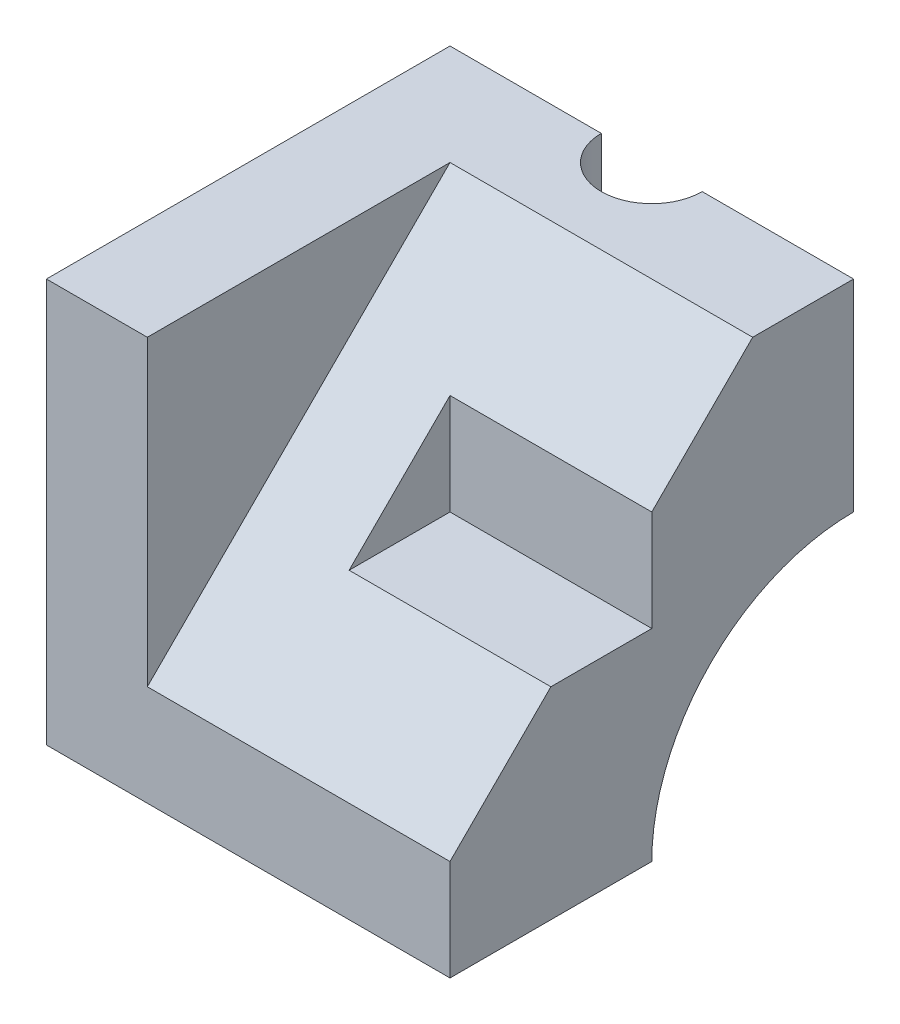
ISO-10303-21;
HEADER;
FILE_DESCRIPTION(('STEP AP214'),'2;1');
FILE_NAME('part.step','',(''),(''),'','','');
FILE_SCHEMA(('AUTOMOTIVE_DESIGN { 1 0 10303 214 1 1 1 1 }'));
ENDSEC;
DATA;
#1=APPLICATION_CONTEXT('core data for automotive mechanical design processes');
#2=APPLICATION_PROTOCOL_DEFINITION('international standard','automotive_design',2000,#1);
#3=PRODUCT_CONTEXT('',#1,'mechanical');
#4=PRODUCT('Part','Part','',(#3));
#5=PRODUCT_RELATED_PRODUCT_CATEGORY('part','',(#4));
#6=PRODUCT_DEFINITION_FORMATION('','',#4);
#7=PRODUCT_DEFINITION_CONTEXT('part definition',#1,'design');
#8=PRODUCT_DEFINITION('design','',#6,#7);
#9=PRODUCT_DEFINITION_SHAPE('','',#8);
#10=(LENGTH_UNIT() NAMED_UNIT(*) SI_UNIT(.MILLI.,.METRE.));
#11=(NAMED_UNIT(*) PLANE_ANGLE_UNIT() SI_UNIT($,.RADIAN.));
#12=(NAMED_UNIT(*) SI_UNIT($,.STERADIAN.) SOLID_ANGLE_UNIT());
#13=UNCERTAINTY_MEASURE_WITH_UNIT(LENGTH_MEASURE(1.E-05),#10,'distance_accuracy_value','');
#14=(GEOMETRIC_REPRESENTATION_CONTEXT(3) GLOBAL_UNCERTAINTY_ASSIGNED_CONTEXT((#13)) GLOBAL_UNIT_ASSIGNED_CONTEXT((#10,
#11,#12)) REPRESENTATION_CONTEXT('',''));
#15=CARTESIAN_POINT('',(0.,0.,0.));
#16=DIRECTION('',(0.,0.,1.));
#17=DIRECTION('',(1.,0.,0.));
#18=AXIS2_PLACEMENT_3D('',#15,#16,#17);
#19=CARTESIAN_POINT('',(0.,80.,40.));
#20=DIRECTION('',(0.,-1.,0.));
#21=DIRECTION('',(0.,0.,-1.));
#22=AXIS2_PLACEMENT_3D('',#19,#20,#21);
#23=PLANE('',#22);
#24=CARTESIAN_POINT('',(40.,80.,-40.));
#25=DIRECTION('',(0.,1.,0.));
#26=DIRECTION('',(0.,0.,1.));
#27=AXIS2_PLACEMENT_3D('',#24,#25,#26);
#28=CIRCLE('',#27,10.);
#29=CARTESIAN_POINT('',(30.,80.,-40.));
#30=VERTEX_POINT('',#29);
#31=CARTESIAN_POINT('',(50.,80.,-40.));
#32=VERTEX_POINT('',#31);
#33=EDGE_CURVE('E134',#30,#32,#28,.T.);
#34=ORIENTED_EDGE('',*,*,#33,.F.);
#35=DIRECTION('',(-1.,0.,0.));
#36=VECTOR('',#35,1.);
#37=CARTESIAN_POINT('',(0.,80.,-40.));
#38=LINE('',#37,#36);
#39=CARTESIAN_POINT('',(0.,80.,-40.));
#40=VERTEX_POINT('',#39);
#41=EDGE_CURVE('E143',#30,#40,#38,.T.);
#42=ORIENTED_EDGE('',*,*,#41,.T.);
#43=DIRECTION('',(0.,0.,-1.));
#44=VECTOR('',#43,1.);
#45=CARTESIAN_POINT('',(0.,80.,40.));
#46=LINE('',#45,#44);
#47=CARTESIAN_POINT('',(0.,80.,40.));
#48=VERTEX_POINT('',#47);
#49=EDGE_CURVE('E164',#48,#40,#46,.T.);
#50=ORIENTED_EDGE('',*,*,#49,.F.);
#51=DIRECTION('',(-1.,0.,0.));
#52=VECTOR('',#51,1.);
#53=CARTESIAN_POINT('',(0.,80.,40.));
#54=LINE('',#53,#52);
#55=CARTESIAN_POINT('',(20.,80.,40.));
#56=VERTEX_POINT('',#55);
#57=EDGE_CURVE('E187',#56,#48,#54,.T.);
#58=ORIENTED_EDGE('',*,*,#57,.F.);
#59=DIRECTION('',(0.,0.,-1.));
#60=VECTOR('',#59,1.);
#61=CARTESIAN_POINT('',(20.,80.,40.));
#62=LINE('',#61,#60);
#63=CARTESIAN_POINT('',(20.,80.,-20.));
#64=VERTEX_POINT('',#63);
#65=EDGE_CURVE('E167',#56,#64,#62,.T.);
#66=ORIENTED_EDGE('',*,*,#65,.T.);
#67=DIRECTION('',(-1.,0.,0.));
#68=VECTOR('',#67,1.);
#69=CARTESIAN_POINT('',(80.,80.,-20.));
#70=LINE('',#69,#68);
#71=CARTESIAN_POINT('',(80.,80.,-20.));
#72=VERTEX_POINT('',#71);
#73=EDGE_CURVE('E193',#72,#64,#70,.T.);
#74=ORIENTED_EDGE('',*,*,#73,.F.);
#75=DIRECTION('',(0.,0.,1.));
#76=VECTOR('',#75,1.);
#77=CARTESIAN_POINT('',(80.,80.,-40.));
#78=LINE('',#77,#76);
#79=CARTESIAN_POINT('',(80.,80.,-40.));
#80=VERTEX_POINT('',#79);
#81=EDGE_CURVE('E215',#80,#72,#78,.T.);
#82=ORIENTED_EDGE('',*,*,#81,.F.);
#83=EDGE_CURVE('E146',#80,#32,#38,.T.);
#84=ORIENTED_EDGE('',*,*,#83,.T.);
#85=EDGE_LOOP('',(#34,#42,#50,#58,#66,#74,#82,#84));
#86=FACE_BOUND('',#85,.T.);
#87=ADVANCED_FACE('F32',(#86),#23,.F.);
#88=CARTESIAN_POINT('',(0.,0.,-40.));
#89=DIRECTION('',(0.,0.,-1.));
#90=DIRECTION('',(-1.,0.,0.));
#91=AXIS2_PLACEMENT_3D('',#88,#89,#90);
#92=PLANE('',#91);
#93=DIRECTION('',(-1.,0.,0.));
#94=VECTOR('',#93,1.);
#95=CARTESIAN_POINT('',(80.,40.,-40.));
#96=LINE('',#95,#94);
#97=CARTESIAN_POINT('',(80.,40.,-40.));
#98=VERTEX_POINT('',#97);
#99=CARTESIAN_POINT('',(50.,40.,-40.));
#100=VERTEX_POINT('',#99);
#101=EDGE_CURVE('E201',#98,#100,#96,.T.);
#102=ORIENTED_EDGE('',*,*,#101,.T.);
#103=DIRECTION('',(0.,-1.,0.));
#104=VECTOR('',#103,1.);
#105=CARTESIAN_POINT('',(50.,80.,-40.));
#106=LINE('',#105,#104);
#107=EDGE_CURVE('E52',#32,#100,#106,.T.);
#108=ORIENTED_EDGE('',*,*,#107,.F.);
#109=ORIENTED_EDGE('',*,*,#83,.F.);
#110=DIRECTION('',(0.,1.,0.));
#111=VECTOR('',#110,1.);
#112=CARTESIAN_POINT('',(80.,80.,-40.));
#113=LINE('',#112,#111);
#114=EDGE_CURVE('E217',#98,#80,#113,.T.);
#115=ORIENTED_EDGE('',*,*,#114,.F.);
#116=EDGE_LOOP('',(#102,#108,#109,#115));
#117=FACE_BOUND('',#116,.T.);
#118=ADVANCED_FACE('F268',(#117),#92,.T.);
#119=ORIENTED_EDGE('',*,*,#41,.F.);
#120=DIRECTION('',(0.,-1.,0.));
#121=VECTOR('',#120,1.);
#122=CARTESIAN_POINT('',(30.,80.,-40.));
#123=LINE('',#122,#121);
#124=CARTESIAN_POINT('',(30.,40.,-40.));
#125=VERTEX_POINT('',#124);
#126=EDGE_CURVE('E131',#30,#125,#123,.T.);
#127=ORIENTED_EDGE('',*,*,#126,.T.);
#128=CARTESIAN_POINT('',(20.,40.,-40.));
#129=VERTEX_POINT('',#128);
#130=EDGE_CURVE('E179',#125,#129,#96,.T.);
#131=ORIENTED_EDGE('',*,*,#130,.T.);
#132=DIRECTION('',(0.,1.,0.));
#133=VECTOR('',#132,1.);
#134=CARTESIAN_POINT('',(20.,80.,-40.));
#135=LINE('',#134,#133);
#136=CARTESIAN_POINT('',(20.,0.,-40.));
#137=VERTEX_POINT('',#136);
#138=EDGE_CURVE('E153',#137,#129,#135,.T.);
#139=ORIENTED_EDGE('',*,*,#138,.F.);
#140=DIRECTION('',(1.,0.,0.));
#141=VECTOR('',#140,1.);
#142=CARTESIAN_POINT('',(20.,0.,-40.));
#143=LINE('',#142,#141);
#144=CARTESIAN_POINT('',(0.,0.,-40.));
#145=VERTEX_POINT('',#144);
#146=EDGE_CURVE('E156',#145,#137,#143,.T.);
#147=ORIENTED_EDGE('',*,*,#146,.F.);
#148=DIRECTION('',(0.,-1.,0.));
#149=VECTOR('',#148,1.);
#150=CARTESIAN_POINT('',(0.,0.,-40.));
#151=LINE('',#150,#149);
#152=EDGE_CURVE('E152',#40,#145,#151,.T.);
#153=ORIENTED_EDGE('',*,*,#152,.F.);
#154=EDGE_LOOP('',(#119,#127,#131,#139,#147,#153));
#155=FACE_BOUND('',#154,.T.);
#156=ADVANCED_FACE('F149',(#155),#92,.T.);
#157=CARTESIAN_POINT('',(80.,0.,-40.));
#158=DIRECTION('',(-1.,0.,0.));
#159=DIRECTION('',(0.,0.,1.));
#160=AXIS2_PLACEMENT_3D('',#157,#158,#159);
#161=CYLINDRICAL_SURFACE('',#160,40.);
#162=CARTESIAN_POINT('',(50.,40.,-40.));
#163=CARTESIAN_POINT('',(50.0000347665634,40.0000283042969,-39.723317328283));
#164=CARTESIAN_POINT('',(49.9885185471952,39.9971302511347,-39.4466450005706));
#165=CARTESIAN_POINT('',(49.9426393211118,39.9856869917149,-38.8953604008497));
#166=CARTESIAN_POINT('',(49.9082798676551,39.9771426637348,-38.6207478151663));
#167=CARTESIAN_POINT('',(49.8170559310698,39.9546336953666,-38.0760525685714));
#168=CARTESIAN_POINT('',(49.7602343187812,39.9406793813447,-37.8059622941188));
#169=CARTESIAN_POINT('',(49.6245652514397,39.9077423587186,-37.2716860705147));
#170=CARTESIAN_POINT('',(49.5457175626522,39.8887595967542,-37.007500184051));
#171=CARTESIAN_POINT('',(49.3666470764717,39.8462862503233,-36.4869280686835));
#172=CARTESIAN_POINT('',(49.266429689706,39.8227968070611,-36.230539884208));
#173=CARTESIAN_POINT('',(49.0453370055672,39.7719316584919,-35.727122115615));
#174=CARTESIAN_POINT('',(48.9244540790586,39.744554518591,-35.4800960290141));
#175=CARTESIAN_POINT('',(48.6629426466438,39.686651714144,-34.9971167522794));
#176=CARTESIAN_POINT('',(48.5223140991924,39.6561260429733,-34.7611635854447));
#177=CARTESIAN_POINT('',(48.2222923619033,39.5927341730655,-34.3018279358429));
#178=CARTESIAN_POINT('',(48.0628983449775,39.5598678711903,-34.078446007795));
#179=CARTESIAN_POINT('',(47.7233322633288,39.4920458815768,-33.6416945303948));
#180=CARTESIAN_POINT('',(47.5428327323561,39.4570629286792,-33.42858375593));
#181=CARTESIAN_POINT('',(47.1647023313839,39.3865264597594,-33.0182464174608));
#182=CARTESIAN_POINT('',(46.967071285234,39.3509729378736,-32.8210200168236));
#183=CARTESIAN_POINT('',(46.5559340088343,39.2802655885801,-32.4437050342399));
#184=CARTESIAN_POINT('',(46.342424630118,39.2451118420444,-32.2636198674033));
#185=CARTESIAN_POINT('',(45.9009576655237,39.1761888998175,-31.9218428341867));
#186=CARTESIAN_POINT('',(45.6730004516109,39.1424196685183,-31.7601504945756));
#187=CARTESIAN_POINT('',(45.2005695624557,39.0767244907518,-31.4539776832615));
#188=CARTESIAN_POINT('',(44.955898463365,39.0448340781449,-31.3097939823785));
#189=CARTESIAN_POINT('',(44.4549489475385,38.9844171612595,-31.0426580003598));
#190=CARTESIAN_POINT('',(44.1986750250383,38.9558893696743,-30.9196975859233));
#191=CARTESIAN_POINT('',(43.6762104939899,38.9030460323612,-30.6959020142231));
#192=CARTESIAN_POINT('',(43.4100196626681,38.8787305813287,-30.5950673543438));
#193=CARTESIAN_POINT('',(42.8696420404606,38.8350658200059,-30.4163611118489));
#194=CARTESIAN_POINT('',(42.5954554418739,38.8157163903918,-30.3384889774814));
#195=CARTESIAN_POINT('',(42.0466655263122,38.7829257133539,-30.2077004607008));
#196=CARTESIAN_POINT('',(41.7721803871258,38.7693739659701,-30.154315788423));
#197=CARTESIAN_POINT('',(41.2194826673782,38.7480437402112,-30.070701223761));
#198=CARTESIAN_POINT('',(40.9412701318527,38.7402651921463,-30.040471051872));
#199=CARTESIAN_POINT('',(40.3832205025106,38.7307247036798,-30.0034340255133));
#200=CARTESIAN_POINT('',(40.1033836066688,38.7289620448772,-29.9966243742286));
#201=CARTESIAN_POINT('',(39.5441535158876,38.7315067768714,-30.0064816189487));
#202=CARTESIAN_POINT('',(39.2647603148346,38.7358140832899,-30.0231481886118));
#203=CARTESIAN_POINT('',(38.7152685490798,38.7501861910842,-30.0791192160617));
#204=CARTESIAN_POINT('',(38.4451090329656,38.760108640408,-30.1178641187879));
#205=CARTESIAN_POINT('',(37.9091057010663,38.7853086981301,-30.2172369545841));
#206=CARTESIAN_POINT('',(37.6432618050661,38.8005862068736,-30.277864480431));
#207=CARTESIAN_POINT('',(37.1177545814724,38.8360478604504,-30.4205021508954));
#208=CARTESIAN_POINT('',(36.8580903753497,38.8562313032062,-30.502509236053));
#209=CARTESIAN_POINT('',(36.3465439458482,38.9009355349684,-30.6873072107764));
#210=CARTESIAN_POINT('',(36.0946647294828,38.9254579759487,-30.7901060184533));
#211=CARTESIAN_POINT('',(35.5980344076375,38.9784009900661,-31.0167975077233));
#212=CARTESIAN_POINT('',(35.3533759391039,39.0068570093329,-31.140884801447));
#213=CARTESIAN_POINT('',(34.8752382160931,39.0666979328467,-31.4086132375937));
#214=CARTESIAN_POINT('',(34.6417640168323,39.0980841429688,-31.5522631115253));
#215=CARTESIAN_POINT('',(34.1875569055162,39.1629155393051,-31.8581037115353));
#216=CARTESIAN_POINT('',(33.9668255286815,39.19636097261,-32.0202966646469));
#217=CARTESIAN_POINT('',(33.539602931786,39.2643892775372,-32.3620636225994));
#218=CARTESIAN_POINT('',(33.3331057748481,39.2989716659545,-32.541630305084));
#219=CARTESIAN_POINT('',(32.9297970941818,39.369368886371,-32.9224753503197));
#220=CARTESIAN_POINT('',(32.7334367633066,39.4051904945485,-33.1242305799012));
#221=CARTESIAN_POINT('',(32.3584232949008,39.4760660657393,-33.5435766715787));
#222=CARTESIAN_POINT('',(32.1797642662635,39.5111202810997,-33.7611622231484));
#223=CARTESIAN_POINT('',(31.8412277437747,39.579515677554,-34.2108993137889));
#224=CARTESIAN_POINT('',(31.6813588550706,39.6128560698821,-34.44305745245));
#225=CARTESIAN_POINT('',(31.3816454248162,39.6768773388274,-34.9202994691606));
#226=CARTESIAN_POINT('',(31.2418002226583,39.7075583031693,-35.1653829204218));
#227=CARTESIAN_POINT('',(30.9826505576209,39.7655198411576,-35.6678373170845));
#228=CARTESIAN_POINT('',(30.8634312432958,39.7927861964175,-35.9252538474225));
#229=CARTESIAN_POINT('',(30.6471722625592,39.8429958536219,-36.4496417413058));
#230=CARTESIAN_POINT('',(30.5501316636389,39.8659393373152,-36.7166127025868));
#231=CARTESIAN_POINT('',(30.3791286205496,39.9068198810981,-37.2578676682618));
#232=CARTESIAN_POINT('',(30.3051387882489,39.9247628798976,-37.5321425703149));
#233=CARTESIAN_POINT('',(30.1807419429283,39.9551523105591,-38.0861740557706));
#234=CARTESIAN_POINT('',(30.1303239751867,39.9676012955425,-38.3659280297372));
#235=CARTESIAN_POINT('',(30.0612981868894,39.9847081712133,-38.8715529561821));
#236=CARTESIAN_POINT('',(30.038304107234,39.9904362059273,-39.0967995262256));
#237=CARTESIAN_POINT('',(30.0076612546209,39.9980848315484,-39.5480246224444));
#238=CARTESIAN_POINT('',(29.9999872514112,40.0000116824683,-39.7740013302568));
#239=CARTESIAN_POINT('',(30.,40.,-40.));
#240=B_SPLINE_CURVE_WITH_KNOTS('',3,(#162,#163,#164,#165,#166,#167,#168,#169,#170,#171,#172,
#173,#174,#175,#176,#177,#178,#179,#180,#181,#182,#183,#184,#185,#186,#187,#188,#189,#190,#191,
#192,#193,#194,#195,#196,#197,#198,#199,#200,#201,#202,#203,#204,#205,#206,#207,#208,#209,#210,
#211,#212,#213,#214,#215,#216,#217,#218,#219,#220,#221,#222,#223,#224,#225,#226,#227,#228,#229,
#230,#231,#232,#233,#234,#235,#236,#237,#238,#239),.UNSPECIFIED.,.F.,.F.,(4,2,2,2,2,2,2,2,2,2,2,
2,2,2,2,2,2,2,2,2,2,2,2,2,2,2,2,2,2,2,2,2,2,2,2,2,2,2,4),(0.,0.829777568571717,1.65942609567536,
2.48749875804593,3.31558020802563,4.14345224319137,4.97163056802186,5.79981063538328,
6.62802721846207,7.4714338441084,8.31484914289807,9.15843212816729,10.0019934038801,
10.8582926130778,11.7142629345985,12.5702524962556,13.426221488209,14.2650584142826,
15.103885214348,15.9426118405155,16.7813268077029,17.5996748463457,18.4180076567826,
19.2362234262952,20.0547513856093,20.881205091851,21.7080288916229,22.5349520978711,
23.3615282935914,24.211947007066,25.062081738302,25.9126042933244,26.763098782027,
27.6170246164419,28.4709145407559,29.3237859984146,30.1762607000365,30.8551951942103,
31.5330106426563),.UNSPECIFIED.);
#241=EDGE_CURVE('E11',#100,#125,#240,.T.);
#242=ORIENTED_EDGE('',*,*,#241,.F.);
#243=ORIENTED_EDGE('',*,*,#101,.F.);
#244=CARTESIAN_POINT('',(80.,0.,-40.));
#245=DIRECTION('',(-1.,0.,0.));
#246=DIRECTION('',(0.,0.,1.));
#247=AXIS2_PLACEMENT_3D('',#244,#245,#246);
#248=CIRCLE('',#247,40.);
#249=CARTESIAN_POINT('',(80.,0.,0.));
#250=VERTEX_POINT('',#249);
#251=EDGE_CURVE('E204',#250,#98,#248,.T.);
#252=ORIENTED_EDGE('',*,*,#251,.F.);
#253=DIRECTION('',(-1.,0.,0.));
#254=VECTOR('',#253,1.);
#255=CARTESIAN_POINT('',(80.,0.,0.));
#256=LINE('',#255,#254);
#257=CARTESIAN_POINT('',(20.,0.,0.));
#258=VERTEX_POINT('',#257);
#259=EDGE_CURVE('E199',#250,#258,#256,.T.);
#260=ORIENTED_EDGE('',*,*,#259,.T.);
#261=CARTESIAN_POINT('',(20.,0.,-40.));
#262=DIRECTION('',(-1.,0.,0.));
#263=DIRECTION('',(0.,0.,1.));
#264=AXIS2_PLACEMENT_3D('',#261,#262,#263);
#265=CIRCLE('',#264,40.);
#266=EDGE_CURVE('E174',#258,#129,#265,.T.);
#267=ORIENTED_EDGE('',*,*,#266,.T.);
#268=ORIENTED_EDGE('',*,*,#130,.F.);
#269=EDGE_LOOP('',(#242,#243,#252,#260,#267,#268));
#270=FACE_BOUND('',#269,.T.);
#271=ADVANCED_FACE('F266',(#270),#161,.F.);
#272=CARTESIAN_POINT('',(20.,80.,40.));
#273=DIRECTION('',(-1.,0.,0.));
#274=DIRECTION('',(0.,0.,1.));
#275=AXIS2_PLACEMENT_3D('',#272,#273,#274);
#276=PLANE('',#275);
#277=DIRECTION('',(0.,-0.707106781186548,0.707106781186547));
#278=VECTOR('',#277,1.);
#279=CARTESIAN_POINT('',(20.,50.,10.));
#280=LINE('',#279,#278);
#281=CARTESIAN_POINT('',(20.,20.,40.));
#282=VERTEX_POINT('',#281);
#283=EDGE_CURVE('E182',#64,#282,#280,.T.);
#284=ORIENTED_EDGE('',*,*,#283,.F.);
#285=ORIENTED_EDGE('',*,*,#65,.F.);
#286=DIRECTION('',(0.,1.,0.));
#287=VECTOR('',#286,1.);
#288=CARTESIAN_POINT('',(20.,80.,40.));
#289=LINE('',#288,#287);
#290=EDGE_CURVE('E189',#282,#56,#289,.T.);
#291=ORIENTED_EDGE('',*,*,#290,.F.);
#292=EDGE_LOOP('',(#284,#285,#291));
#293=FACE_BOUND('',#292,.T.);
#294=ADVANCED_FACE('F282',(#293),#276,.F.);
#295=ORIENTED_EDGE('',*,*,#266,.F.);
#296=DIRECTION('',(0.,0.,-1.));
#297=VECTOR('',#296,1.);
#298=CARTESIAN_POINT('',(20.,0.,40.));
#299=LINE('',#298,#297);
#300=EDGE_CURVE('E46',#258,#137,#299,.T.);
#301=ORIENTED_EDGE('',*,*,#300,.T.);
#302=ORIENTED_EDGE('',*,*,#138,.T.);
#303=EDGE_LOOP('',(#295,#301,#302));
#304=FACE_BOUND('',#303,.T.);
#305=ADVANCED_FACE('F172',(#304),#276,.F.);
#306=CARTESIAN_POINT('',(20.,0.,40.));
#307=DIRECTION('',(0.,1.,0.));
#308=DIRECTION('',(0.,0.,1.));
#309=AXIS2_PLACEMENT_3D('',#306,#307,#308);
#310=PLANE('',#309);
#311=DIRECTION('',(0.,0.,-1.));
#312=VECTOR('',#311,1.);
#313=CARTESIAN_POINT('',(0.,0.,40.));
#314=LINE('',#313,#312);
#315=CARTESIAN_POINT('',(0.,0.,40.));
#316=VERTEX_POINT('',#315);
#317=EDGE_CURVE('E162',#316,#145,#314,.T.);
#318=ORIENTED_EDGE('',*,*,#317,.T.);
#319=ORIENTED_EDGE('',*,*,#146,.T.);
#320=ORIENTED_EDGE('',*,*,#300,.F.);
#321=ORIENTED_EDGE('',*,*,#259,.F.);
#322=DIRECTION('',(0.,0.,-1.));
#323=VECTOR('',#322,1.);
#324=CARTESIAN_POINT('',(80.,0.,0.));
#325=LINE('',#324,#323);
#326=CARTESIAN_POINT('',(80.,0.,40.));
#327=VERTEX_POINT('',#326);
#328=EDGE_CURVE('E206',#327,#250,#325,.T.);
#329=ORIENTED_EDGE('',*,*,#328,.F.);
#330=DIRECTION('',(1.,0.,0.));
#331=VECTOR('',#330,1.);
#332=CARTESIAN_POINT('',(20.,0.,40.));
#333=LINE('',#332,#331);
#334=EDGE_CURVE('E161',#316,#327,#333,.T.);
#335=ORIENTED_EDGE('',*,*,#334,.F.);
#336=EDGE_LOOP('',(#318,#319,#320,#321,#329,#335));
#337=FACE_BOUND('',#336,.T.);
#338=ADVANCED_FACE('F34',(#337),#310,.F.);
#339=CARTESIAN_POINT('',(0.,0.,40.));
#340=DIRECTION('',(1.,0.,0.));
#341=DIRECTION('',(0.,0.,-1.));
#342=AXIS2_PLACEMENT_3D('',#339,#340,#341);
#343=PLANE('',#342);
#344=ORIENTED_EDGE('',*,*,#317,.F.);
#345=DIRECTION('',(0.,-1.,0.));
#346=VECTOR('',#345,1.);
#347=CARTESIAN_POINT('',(0.,0.,40.));
#348=LINE('',#347,#346);
#349=EDGE_CURVE('E165',#48,#316,#348,.T.);
#350=ORIENTED_EDGE('',*,*,#349,.F.);
#351=ORIENTED_EDGE('',*,*,#49,.T.);
#352=ORIENTED_EDGE('',*,*,#152,.T.);
#353=EDGE_LOOP('',(#344,#350,#351,#352));
#354=FACE_BOUND('',#353,.T.);
#355=ADVANCED_FACE('F279',(#354),#343,.F.);
#356=CARTESIAN_POINT('',(0.,0.,40.));
#357=DIRECTION('',(0.,0.,-1.));
#358=DIRECTION('',(-1.,0.,0.));
#359=AXIS2_PLACEMENT_3D('',#356,#357,#358);
#360=PLANE('',#359);
#361=ORIENTED_EDGE('',*,*,#334,.T.);
#362=DIRECTION('',(0.,-1.,0.));
#363=VECTOR('',#362,1.);
#364=CARTESIAN_POINT('',(80.,0.,40.));
#365=LINE('',#364,#363);
#366=CARTESIAN_POINT('',(80.,20.,40.));
#367=VERTEX_POINT('',#366);
#368=EDGE_CURVE('E208',#367,#327,#365,.T.);
#369=ORIENTED_EDGE('',*,*,#368,.F.);
#370=DIRECTION('',(-1.,0.,0.));
#371=VECTOR('',#370,1.);
#372=CARTESIAN_POINT('',(80.,20.,40.));
#373=LINE('',#372,#371);
#374=EDGE_CURVE('E196',#367,#282,#373,.T.);
#375=ORIENTED_EDGE('',*,*,#374,.T.);
#376=ORIENTED_EDGE('',*,*,#290,.T.);
#377=ORIENTED_EDGE('',*,*,#57,.T.);
#378=ORIENTED_EDGE('',*,*,#349,.T.);
#379=EDGE_LOOP('',(#361,#369,#375,#376,#377,#378));
#380=FACE_BOUND('',#379,.T.);
#381=ADVANCED_FACE('F261',(#380),#360,.F.);
#382=CARTESIAN_POINT('',(80.,20.,40.));
#383=DIRECTION('',(0.,-0.707106781186547,-0.707106781186548));
#384=DIRECTION('',(0.,0.707106781186548,-0.707106781186547));
#385=AXIS2_PLACEMENT_3D('',#382,#383,#384);
#386=PLANE('',#385);
#387=DIRECTION('',(0.,-0.707106781186548,0.707106781186547));
#388=VECTOR('',#387,1.);
#389=CARTESIAN_POINT('',(40.,40.,20.));
#390=LINE('',#389,#388);
#391=CARTESIAN_POINT('',(40.,60.,0.));
#392=VERTEX_POINT('',#391);
#393=CARTESIAN_POINT('',(40.,40.,20.));
#394=VERTEX_POINT('',#393);
#395=EDGE_CURVE('E229',#392,#394,#390,.T.);
#396=ORIENTED_EDGE('',*,*,#395,.F.);
#397=DIRECTION('',(1.,0.,0.));
#398=VECTOR('',#397,1.);
#399=CARTESIAN_POINT('',(40.,60.,0.));
#400=LINE('',#399,#398);
#401=CARTESIAN_POINT('',(80.,60.,0.));
#402=VERTEX_POINT('',#401);
#403=EDGE_CURVE('E220',#392,#402,#400,.T.);
#404=ORIENTED_EDGE('',*,*,#403,.T.);
#405=DIRECTION('',(0.,-0.707106781186548,0.707106781186547));
#406=VECTOR('',#405,1.);
#407=CARTESIAN_POINT('',(80.,20.,40.));
#408=LINE('',#407,#406);
#409=EDGE_CURVE('E211',#72,#402,#408,.T.);
#410=ORIENTED_EDGE('',*,*,#409,.F.);
#411=ORIENTED_EDGE('',*,*,#73,.T.);
#412=ORIENTED_EDGE('',*,*,#283,.T.);
#413=ORIENTED_EDGE('',*,*,#374,.F.);
#414=CARTESIAN_POINT('',(80.,40.,20.));
#415=VERTEX_POINT('',#414);
#416=EDGE_CURVE('E214',#415,#367,#408,.T.);
#417=ORIENTED_EDGE('',*,*,#416,.F.);
#418=DIRECTION('',(1.,0.,0.));
#419=VECTOR('',#418,1.);
#420=CARTESIAN_POINT('',(40.,40.,20.));
#421=LINE('',#420,#419);
#422=EDGE_CURVE('E60',#394,#415,#421,.T.);
#423=ORIENTED_EDGE('',*,*,#422,.F.);
#424=EDGE_LOOP('',(#396,#404,#410,#411,#412,#413,#417,#423));
#425=FACE_BOUND('',#424,.T.);
#426=ADVANCED_FACE('F244',(#425),#386,.F.);
#427=CARTESIAN_POINT('',(80.,0.,-40.));
#428=DIRECTION('',(-1.,0.,0.));
#429=DIRECTION('',(0.,0.,1.));
#430=AXIS2_PLACEMENT_3D('',#427,#428,#429);
#431=PLANE('',#430);
#432=ORIENTED_EDGE('',*,*,#409,.T.);
#433=DIRECTION('',(0.,1.,0.));
#434=VECTOR('',#433,1.);
#435=CARTESIAN_POINT('',(80.,60.,0.));
#436=LINE('',#435,#434);
#437=CARTESIAN_POINT('',(80.,40.,0.));
#438=VERTEX_POINT('',#437);
#439=EDGE_CURVE('E227',#438,#402,#436,.T.);
#440=ORIENTED_EDGE('',*,*,#439,.F.);
#441=DIRECTION('',(0.,0.,-1.));
#442=VECTOR('',#441,1.);
#443=CARTESIAN_POINT('',(80.,40.,0.));
#444=LINE('',#443,#442);
#445=EDGE_CURVE('E138',#415,#438,#444,.T.);
#446=ORIENTED_EDGE('',*,*,#445,.F.);
#447=ORIENTED_EDGE('',*,*,#416,.T.);
#448=ORIENTED_EDGE('',*,*,#368,.T.);
#449=ORIENTED_EDGE('',*,*,#328,.T.);
#450=ORIENTED_EDGE('',*,*,#251,.T.);
#451=ORIENTED_EDGE('',*,*,#114,.T.);
#452=ORIENTED_EDGE('',*,*,#81,.T.);
#453=EDGE_LOOP('',(#432,#440,#446,#447,#448,#449,#450,#451,#452));
#454=FACE_BOUND('',#453,.T.);
#455=ADVANCED_FACE('F248',(#454),#431,.F.);
#456=CARTESIAN_POINT('',(40.,60.,0.));
#457=DIRECTION('',(0.,0.,-1.));
#458=DIRECTION('',(-1.,0.,0.));
#459=AXIS2_PLACEMENT_3D('',#456,#457,#458);
#460=PLANE('',#459);
#461=ORIENTED_EDGE('',*,*,#439,.T.);
#462=ORIENTED_EDGE('',*,*,#403,.F.);
#463=DIRECTION('',(0.,1.,0.));
#464=VECTOR('',#463,1.);
#465=CARTESIAN_POINT('',(40.,60.,0.));
#466=LINE('',#465,#464);
#467=CARTESIAN_POINT('',(40.,40.,0.));
#468=VERTEX_POINT('',#467);
#469=EDGE_CURVE('E223',#468,#392,#466,.T.);
#470=ORIENTED_EDGE('',*,*,#469,.F.);
#471=DIRECTION('',(1.,0.,0.));
#472=VECTOR('',#471,1.);
#473=CARTESIAN_POINT('',(40.,40.,0.));
#474=LINE('',#473,#472);
#475=EDGE_CURVE('E222',#468,#438,#474,.T.);
#476=ORIENTED_EDGE('',*,*,#475,.T.);
#477=EDGE_LOOP('',(#461,#462,#470,#476));
#478=FACE_BOUND('',#477,.T.);
#479=ADVANCED_FACE('F253',(#478),#460,.F.);
#480=CARTESIAN_POINT('',(40.,40.,0.));
#481=DIRECTION('',(0.,-1.,0.));
#482=DIRECTION('',(0.,0.,-1.));
#483=AXIS2_PLACEMENT_3D('',#480,#481,#482);
#484=PLANE('',#483);
#485=ORIENTED_EDGE('',*,*,#445,.T.);
#486=ORIENTED_EDGE('',*,*,#475,.F.);
#487=DIRECTION('',(0.,0.,-1.));
#488=VECTOR('',#487,1.);
#489=CARTESIAN_POINT('',(40.,40.,0.));
#490=LINE('',#489,#488);
#491=EDGE_CURVE('E233',#394,#468,#490,.T.);
#492=ORIENTED_EDGE('',*,*,#491,.F.);
#493=ORIENTED_EDGE('',*,*,#422,.T.);
#494=EDGE_LOOP('',(#485,#486,#492,#493));
#495=FACE_BOUND('',#494,.T.);
#496=ADVANCED_FACE('F251',(#495),#484,.F.);
#497=CARTESIAN_POINT('',(40.,0.,0.));
#498=DIRECTION('',(-1.,0.,0.));
#499=DIRECTION('',(0.,0.,1.));
#500=AXIS2_PLACEMENT_3D('',#497,#498,#499);
#501=PLANE('',#500);
#502=ORIENTED_EDGE('',*,*,#395,.T.);
#503=ORIENTED_EDGE('',*,*,#491,.T.);
#504=ORIENTED_EDGE('',*,*,#469,.T.);
#505=EDGE_LOOP('',(#502,#503,#504));
#506=FACE_BOUND('',#505,.T.);
#507=ADVANCED_FACE('F240',(#506),#501,.F.);
#508=CARTESIAN_POINT('',(40.,80.,-40.));
#509=DIRECTION('',(0.,-1.,0.));
#510=DIRECTION('',(0.,0.,-1.));
#511=AXIS2_PLACEMENT_3D('',#508,#509,#510);
#512=CYLINDRICAL_SURFACE('',#511,10.);
#513=ORIENTED_EDGE('',*,*,#241,.T.);
#514=ORIENTED_EDGE('',*,*,#126,.F.);
#515=ORIENTED_EDGE('',*,*,#33,.T.);
#516=ORIENTED_EDGE('',*,*,#107,.T.);
#517=EDGE_LOOP('',(#513,#514,#515,#516));
#518=FACE_BOUND('',#517,.T.);
#519=ADVANCED_FACE('F133',(#518),#512,.F.);
#520=CLOSED_SHELL('',(#87,#118,#156,#271,#294,#305,#338,#355,#381,#426,#455,#479,#496,#507,#519));
#521=MANIFOLD_SOLID_BREP('B2',#520);
#522=ADVANCED_BREP_SHAPE_REPRESENTATION('',(#18,#521),#14);
#523=SHAPE_DEFINITION_REPRESENTATION(#9,#522);
ENDSEC;
END-ISO-10303-21;
